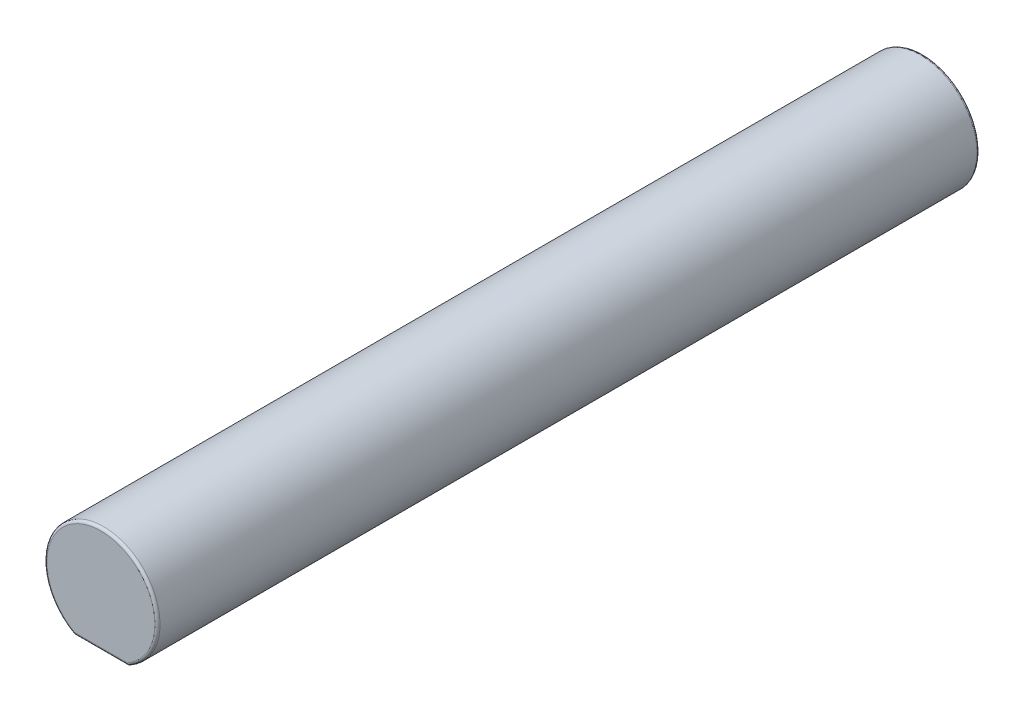
ISO-10303-21;
HEADER;
FILE_DESCRIPTION(('STEP AP214'),'2;1');
FILE_NAME('part.step','',(''),(''),'','','');
FILE_SCHEMA(('AUTOMOTIVE_DESIGN { 1 0 10303 214 1 1 1 1 }'));
ENDSEC;
DATA;
#1=APPLICATION_CONTEXT('core data for automotive mechanical design processes');
#2=APPLICATION_PROTOCOL_DEFINITION('international standard','automotive_design',2000,#1);
#3=PRODUCT_CONTEXT('',#1,'mechanical');
#4=PRODUCT('Part','Part','',(#3));
#5=PRODUCT_RELATED_PRODUCT_CATEGORY('part','',(#4));
#6=PRODUCT_DEFINITION_FORMATION('','',#4);
#7=PRODUCT_DEFINITION_CONTEXT('part definition',#1,'design');
#8=PRODUCT_DEFINITION('design','',#6,#7);
#9=PRODUCT_DEFINITION_SHAPE('','',#8);
#10=(LENGTH_UNIT() NAMED_UNIT(*) SI_UNIT(.MILLI.,.METRE.));
#11=(NAMED_UNIT(*) PLANE_ANGLE_UNIT() SI_UNIT($,.RADIAN.));
#12=(NAMED_UNIT(*) SI_UNIT($,.STERADIAN.) SOLID_ANGLE_UNIT());
#13=UNCERTAINTY_MEASURE_WITH_UNIT(LENGTH_MEASURE(1.E-05),#10,'distance_accuracy_value','');
#14=(GEOMETRIC_REPRESENTATION_CONTEXT(3) GLOBAL_UNCERTAINTY_ASSIGNED_CONTEXT((#13)) GLOBAL_UNIT_ASSIGNED_CONTEXT((#10,
#11,#12)) REPRESENTATION_CONTEXT('',''));
#15=CARTESIAN_POINT('',(0.,0.,0.));
#16=DIRECTION('',(0.,0.,1.));
#17=DIRECTION('',(1.,0.,0.));
#18=AXIS2_PLACEMENT_3D('',#15,#16,#17);
#19=CARTESIAN_POINT('',(10.5,18.,171.));
#20=DIRECTION('',(0.,0.,1.));
#21=DIRECTION('',(1.,0.,0.));
#22=AXIS2_PLACEMENT_3D('',#19,#20,#21);
#23=PLANE('',#22);
#24=DIRECTION('',(1.,0.,0.));
#25=VECTOR('',#24,1.);
#26=CARTESIAN_POINT('',(10.5,-10.1326149291812,171.));
#27=LINE('',#26,#25);
#28=CARTESIAN_POINT('',(4.90559839249728,-10.1326149291812,171.));
#29=VERTEX_POINT('',#28);
#30=CARTESIAN_POINT('',(10.5,-10.1326149291812,171.));
#31=VERTEX_POINT('',#30);
#32=EDGE_CURVE('E173',#29,#31,#27,.T.);
#33=ORIENTED_EDGE('',*,*,#32,.F.);
#34=DIRECTION('',(0.,-1.,0.));
#35=VECTOR('',#34,1.);
#36=CARTESIAN_POINT('',(4.90559839249728,129.432758120554,171.));
#37=LINE('',#36,#35);
#38=CARTESIAN_POINT('',(4.90559839249728,18.,171.));
#39=VERTEX_POINT('',#38);
#40=EDGE_CURVE('E160',#39,#29,#37,.T.);
#41=ORIENTED_EDGE('',*,*,#40,.F.);
#42=DIRECTION('',(-1.,0.,0.));
#43=VECTOR('',#42,1.);
#44=CARTESIAN_POINT('',(10.5,18.,171.));
#45=LINE('',#44,#43);
#46=CARTESIAN_POINT('',(10.5,18.,171.));
#47=VERTEX_POINT('',#46);
#48=EDGE_CURVE('E172',#47,#39,#45,.T.);
#49=ORIENTED_EDGE('',*,*,#48,.F.);
#50=DIRECTION('',(0.,-1.,0.));
#51=VECTOR('',#50,1.);
#52=CARTESIAN_POINT('',(10.5,18.,171.));
#53=LINE('',#52,#51);
#54=EDGE_CURVE('E195',#47,#31,#53,.T.);
#55=ORIENTED_EDGE('',*,*,#54,.T.);
#56=EDGE_LOOP('',(#33,#41,#49,#55));
#57=FACE_BOUND('',#56,.T.);
#58=ADVANCED_FACE('F32',(#57),#23,.F.);
#59=CARTESIAN_POINT('',(10.5,-10.1326149291812,179.));
#60=DIRECTION('',(0.,0.,1.));
#61=DIRECTION('',(1.,0.,0.));
#62=AXIS2_PLACEMENT_3D('',#59,#60,#61);
#63=PLANE('',#62);
#64=DIRECTION('',(-1.,0.,0.));
#65=VECTOR('',#64,1.);
#66=CARTESIAN_POINT('',(10.5,-19.3326149291812,179.));
#67=LINE('',#66,#65);
#68=CARTESIAN_POINT('',(10.5,-19.3326149291812,179.));
#69=VERTEX_POINT('',#68);
#70=CARTESIAN_POINT('',(4.90559839249728,-19.3326149291812,179.));
#71=VERTEX_POINT('',#70);
#72=EDGE_CURVE('E313',#69,#71,#67,.T.);
#73=ORIENTED_EDGE('',*,*,#72,.T.);
#74=DIRECTION('',(0.,1.,0.));
#75=VECTOR('',#74,1.);
#76=CARTESIAN_POINT('',(4.90559839249728,-10.1326149291812,179.));
#77=LINE('',#76,#75);
#78=CARTESIAN_POINT('',(4.90559839249728,-10.1326149291812,179.));
#79=VERTEX_POINT('',#78);
#80=EDGE_CURVE('E315',#71,#79,#77,.T.);
#81=ORIENTED_EDGE('',*,*,#80,.T.);
#82=DIRECTION('',(-1.,0.,0.));
#83=VECTOR('',#82,1.);
#84=CARTESIAN_POINT('',(10.5,-10.1326149291812,179.));
#85=LINE('',#84,#83);
#86=CARTESIAN_POINT('',(10.5,-10.1326149291812,179.));
#87=VERTEX_POINT('',#86);
#88=EDGE_CURVE('E373',#87,#79,#85,.T.);
#89=ORIENTED_EDGE('',*,*,#88,.F.);
#90=DIRECTION('',(0.,-1.,0.));
#91=VECTOR('',#90,1.);
#92=CARTESIAN_POINT('',(10.5,-10.1326149291812,179.));
#93=LINE('',#92,#91);
#94=EDGE_CURVE('E317',#87,#69,#93,.T.);
#95=ORIENTED_EDGE('',*,*,#94,.T.);
#96=EDGE_LOOP('',(#73,#81,#89,#95));
#97=FACE_BOUND('',#96,.T.);
#98=ADVANCED_FACE('F286',(#97),#63,.F.);
#99=CARTESIAN_POINT('',(0.,-10.1326149291812,0.));
#100=DIRECTION('',(0.,-1.,0.));
#101=DIRECTION('',(1.,0.,0.));
#102=AXIS2_PLACEMENT_3D('',#99,#100,#101);
#103=PLANE('',#102);
#104=DIRECTION('',(0.,0.,1.));
#105=VECTOR('',#104,1.);
#106=CARTESIAN_POINT('',(4.90559839249728,-10.1326149291812,0.));
#107=LINE('',#106,#105);
#108=EDGE_CURVE('E205',#29,#79,#107,.T.);
#109=ORIENTED_EDGE('',*,*,#108,.F.);
#110=ORIENTED_EDGE('',*,*,#32,.T.);
#111=DIRECTION('',(0.,0.,1.));
#112=VECTOR('',#111,1.);
#113=CARTESIAN_POINT('',(10.5,-10.1326149291812,171.));
#114=LINE('',#113,#112);
#115=EDGE_CURVE('E319',#31,#87,#114,.T.);
#116=ORIENTED_EDGE('',*,*,#115,.T.);
#117=ORIENTED_EDGE('',*,*,#88,.T.);
#118=EDGE_LOOP('',(#109,#110,#116,#117));
#119=FACE_BOUND('',#118,.T.);
#120=ADVANCED_FACE('F260',(#119),#103,.T.);
#121=CARTESIAN_POINT('',(-4.90559839249727,18.,171.));
#122=VERTEX_POINT('',#121);
#123=CARTESIAN_POINT('',(-10.5,18.,171.));
#124=VERTEX_POINT('',#123);
#125=EDGE_CURVE('E183',#122,#124,#45,.T.);
#126=ORIENTED_EDGE('',*,*,#125,.F.);
#127=DIRECTION('',(0.,-1.,0.));
#128=VECTOR('',#127,1.);
#129=CARTESIAN_POINT('',(-4.90559839249727,129.432758120554,171.));
#130=LINE('',#129,#128);
#131=CARTESIAN_POINT('',(-4.90559839249727,-10.1326149291812,171.));
#132=VERTEX_POINT('',#131);
#133=EDGE_CURVE('E384',#122,#132,#130,.T.);
#134=ORIENTED_EDGE('',*,*,#133,.T.);
#135=CARTESIAN_POINT('',(-10.5,-10.1326149291812,171.));
#136=VERTEX_POINT('',#135);
#137=EDGE_CURVE('E328',#136,#132,#27,.T.);
#138=ORIENTED_EDGE('',*,*,#137,.F.);
#139=DIRECTION('',(0.,-1.,0.));
#140=VECTOR('',#139,1.);
#141=CARTESIAN_POINT('',(-10.5,18.,171.));
#142=LINE('',#141,#140);
#143=EDGE_CURVE('E191',#124,#136,#142,.T.);
#144=ORIENTED_EDGE('',*,*,#143,.F.);
#145=EDGE_LOOP('',(#126,#134,#138,#144));
#146=FACE_BOUND('',#145,.T.);
#147=ADVANCED_FACE('F237',(#146),#23,.F.);
#148=CARTESIAN_POINT('',(0.,0.,320.));
#149=DIRECTION('',(0.,0.,-1.));
#150=DIRECTION('',(-1.,0.,0.));
#151=AXIS2_PLACEMENT_3D('',#148,#149,#150);
#152=CYLINDRICAL_SURFACE('',#151,22.);
#153=CARTESIAN_POINT('',(0.,0.,1.));
#154=DIRECTION('',(0.,0.,1.));
#155=DIRECTION('',(1.,0.,0.));
#156=AXIS2_PLACEMENT_3D('',#153,#154,#155);
#157=CIRCLE('',#156,22.);
#158=CARTESIAN_POINT('',(22.,0.,1.));
#159=VERTEX_POINT('',#158);
#160=EDGE_CURVE('E207',#159,#159,#157,.T.);
#161=ORIENTED_EDGE('',*,*,#160,.T.);
#162=EDGE_LOOP('',(#161));
#163=FACE_BOUND('',#162,.T.);
#164=DIRECTION('',(0.,0.,1.));
#165=VECTOR('',#164,1.);
#166=CARTESIAN_POINT('',(-10.5,-19.3326149291812,41.));
#167=LINE('',#166,#165);
#168=CARTESIAN_POINT('',(-10.5,-19.3326149291812,179.));
#169=VERTEX_POINT('',#168);
#170=CARTESIAN_POINT('',(-10.5,-19.3326149291812,319.));
#171=VERTEX_POINT('',#170);
#172=EDGE_CURVE('E362',#169,#171,#167,.T.);
#173=ORIENTED_EDGE('',*,*,#172,.T.);
#174=CARTESIAN_POINT('',(0.,0.,319.));
#175=DIRECTION('',(0.,0.,1.));
#176=DIRECTION('',(1.,0.,0.));
#177=AXIS2_PLACEMENT_3D('',#174,#175,#176);
#178=CIRCLE('',#177,22.);
#179=CARTESIAN_POINT('',(10.5,-19.3326149291812,319.));
#180=VERTEX_POINT('',#179);
#181=EDGE_CURVE('E11',#171,#180,#178,.F.);
#182=ORIENTED_EDGE('',*,*,#181,.T.);
#183=DIRECTION('',(0.,0.,1.));
#184=VECTOR('',#183,1.);
#185=CARTESIAN_POINT('',(10.5,-19.3326149291812,41.));
#186=LINE('',#185,#184);
#187=EDGE_CURVE('E358',#69,#180,#186,.T.);
#188=ORIENTED_EDGE('',*,*,#187,.F.);
#189=DIRECTION('',(0.,0.,-1.));
#190=VECTOR('',#189,1.);
#191=CARTESIAN_POINT('',(10.5,-19.3326149291812,320.));
#192=LINE('',#191,#190);
#193=CARTESIAN_POINT('',(10.5,-19.3326149291812,121.));
#194=VERTEX_POINT('',#193);
#195=EDGE_CURVE('E201',#69,#194,#192,.T.);
#196=ORIENTED_EDGE('',*,*,#195,.T.);
#197=CARTESIAN_POINT('',(10.5,-19.3326149291812,41.));
#198=VERTEX_POINT('',#197);
#199=EDGE_CURVE('E359',#198,#194,#186,.T.);
#200=ORIENTED_EDGE('',*,*,#199,.F.);
#201=CARTESIAN_POINT('',(0.,0.,41.));
#202=DIRECTION('',(0.,0.,-1.));
#203=DIRECTION('',(1.,0.,0.));
#204=AXIS2_PLACEMENT_3D('',#201,#202,#203);
#205=CIRCLE('',#204,22.);
#206=CARTESIAN_POINT('',(-10.5,-19.3326149291812,41.));
#207=VERTEX_POINT('',#206);
#208=EDGE_CURVE('E333',#198,#207,#205,.T.);
#209=ORIENTED_EDGE('',*,*,#208,.T.);
#210=CARTESIAN_POINT('',(-10.5,-19.3326149291812,121.));
#211=VERTEX_POINT('',#210);
#212=EDGE_CURVE('E363',#207,#211,#167,.T.);
#213=ORIENTED_EDGE('',*,*,#212,.T.);
#214=DIRECTION('',(0.,0.,-1.));
#215=VECTOR('',#214,1.);
#216=CARTESIAN_POINT('',(-10.5,-19.3326149291812,320.));
#217=LINE('',#216,#215);
#218=EDGE_CURVE('E194',#211,#169,#217,.F.);
#219=ORIENTED_EDGE('',*,*,#218,.T.);
#220=EDGE_LOOP('',(#173,#182,#188,#196,#200,#209,#213,#219));
#221=FACE_BOUND('',#220,.T.);
#222=ADVANCED_FACE('F233',(#163,#221),#152,.T.);
#223=CARTESIAN_POINT('',(0.,0.,320.));
#224=DIRECTION('',(0.,0.,1.));
#225=DIRECTION('',(1.,0.,0.));
#226=AXIS2_PLACEMENT_3D('',#223,#224,#225);
#227=PLANE('',#226);
#228=CARTESIAN_POINT('',(0.,0.,320.));
#229=DIRECTION('',(0.,0.,1.));
#230=DIRECTION('',(1.,0.,0.));
#231=AXIS2_PLACEMENT_3D('',#228,#229,#230);
#232=CIRCLE('',#231,21.);
#233=CARTESIAN_POINT('',(10.2428135713955,-18.3326149291812,320.));
#234=VERTEX_POINT('',#233);
#235=CARTESIAN_POINT('',(-10.2428135713955,-18.3326149291812,320.));
#236=VERTEX_POINT('',#235);
#237=EDGE_CURVE('E213',#234,#236,#232,.T.);
#238=ORIENTED_EDGE('',*,*,#237,.T.);
#239=DIRECTION('',(1.,0.,0.));
#240=VECTOR('',#239,1.);
#241=CARTESIAN_POINT('',(0.,-18.3326149291812,320.));
#242=LINE('',#241,#240);
#243=EDGE_CURVE('E215',#236,#234,#242,.T.);
#244=ORIENTED_EDGE('',*,*,#243,.T.);
#245=EDGE_LOOP('',(#238,#244));
#246=FACE_BOUND('',#245,.T.);
#247=ADVANCED_FACE('F236',(#246),#227,.T.);
#248=CARTESIAN_POINT('',(10.5,18.,129.));
#249=DIRECTION('',(0.,0.,-1.));
#250=DIRECTION('',(-1.,0.,0.));
#251=AXIS2_PLACEMENT_3D('',#248,#249,#250);
#252=PLANE('',#251);
#253=DIRECTION('',(0.,-1.,0.));
#254=VECTOR('',#253,1.);
#255=CARTESIAN_POINT('',(-10.5,18.,129.));
#256=LINE('',#255,#254);
#257=CARTESIAN_POINT('',(-10.5,18.,129.));
#258=VERTEX_POINT('',#257);
#259=CARTESIAN_POINT('',(-10.5,-10.1326149291812,129.));
#260=VERTEX_POINT('',#259);
#261=EDGE_CURVE('E182',#258,#260,#256,.T.);
#262=ORIENTED_EDGE('',*,*,#261,.T.);
#263=DIRECTION('',(-1.,0.,0.));
#264=VECTOR('',#263,1.);
#265=CARTESIAN_POINT('',(10.5,-10.1326149291812,129.));
#266=LINE('',#265,#264);
#267=CARTESIAN_POINT('',(10.5,-10.1326149291812,129.));
#268=VERTEX_POINT('',#267);
#269=EDGE_CURVE('E337',#268,#260,#266,.T.);
#270=ORIENTED_EDGE('',*,*,#269,.F.);
#271=DIRECTION('',(0.,-1.,0.));
#272=VECTOR('',#271,1.);
#273=CARTESIAN_POINT('',(10.5,18.,129.));
#274=LINE('',#273,#272);
#275=CARTESIAN_POINT('',(10.5,18.,129.));
#276=VERTEX_POINT('',#275);
#277=EDGE_CURVE('E186',#276,#268,#274,.T.);
#278=ORIENTED_EDGE('',*,*,#277,.F.);
#279=DIRECTION('',(1.,0.,0.));
#280=VECTOR('',#279,1.);
#281=CARTESIAN_POINT('',(10.5,18.,129.));
#282=LINE('',#281,#280);
#283=EDGE_CURVE('E367',#258,#276,#282,.T.);
#284=ORIENTED_EDGE('',*,*,#283,.F.);
#285=EDGE_LOOP('',(#262,#270,#278,#284));
#286=FACE_BOUND('',#285,.T.);
#287=ADVANCED_FACE('F243',(#286),#252,.F.);
#288=CARTESIAN_POINT('',(0.,0.,0.));
#289=DIRECTION('',(0.,0.,1.));
#290=DIRECTION('',(1.,0.,0.));
#291=AXIS2_PLACEMENT_3D('',#288,#289,#290);
#292=PLANE('',#291);
#293=CARTESIAN_POINT('',(0.,0.,0.));
#294=DIRECTION('',(0.,0.,1.));
#295=DIRECTION('',(1.,0.,0.));
#296=AXIS2_PLACEMENT_3D('',#293,#294,#295);
#297=CIRCLE('',#296,21.);
#298=CARTESIAN_POINT('',(21.,0.,0.));
#299=VERTEX_POINT('',#298);
#300=EDGE_CURVE('E210',#299,#299,#297,.F.);
#301=ORIENTED_EDGE('',*,*,#300,.T.);
#302=EDGE_LOOP('',(#301));
#303=FACE_BOUND('',#302,.T.);
#304=ADVANCED_FACE('F239',(#303),#292,.F.);
#305=CARTESIAN_POINT('',(-10.5,18.,171.));
#306=DIRECTION('',(-1.,0.,0.));
#307=DIRECTION('',(0.,0.,1.));
#308=AXIS2_PLACEMENT_3D('',#305,#306,#307);
#309=PLANE('',#308);
#310=ORIENTED_EDGE('',*,*,#261,.F.);
#311=DIRECTION('',(0.,0.,-1.));
#312=VECTOR('',#311,1.);
#313=CARTESIAN_POINT('',(-10.5,18.,171.));
#314=LINE('',#313,#312);
#315=EDGE_CURVE('E366',#124,#258,#314,.T.);
#316=ORIENTED_EDGE('',*,*,#315,.F.);
#317=ORIENTED_EDGE('',*,*,#143,.T.);
#318=DIRECTION('',(0.,0.,-1.));
#319=VECTOR('',#318,1.);
#320=CARTESIAN_POINT('',(-10.5,-10.1326149291812,171.));
#321=LINE('',#320,#319);
#322=CARTESIAN_POINT('',(-10.5,-10.1326149291812,179.));
#323=VERTEX_POINT('',#322);
#324=EDGE_CURVE('E374',#323,#136,#321,.T.);
#325=ORIENTED_EDGE('',*,*,#324,.F.);
#326=DIRECTION('',(0.,-1.,0.));
#327=VECTOR('',#326,1.);
#328=CARTESIAN_POINT('',(-10.5,-10.1326149291812,179.));
#329=LINE('',#328,#327);
#330=EDGE_CURVE('E330',#323,#169,#329,.T.);
#331=ORIENTED_EDGE('',*,*,#330,.T.);
#332=ORIENTED_EDGE('',*,*,#218,.F.);
#333=DIRECTION('',(0.,-1.,0.));
#334=VECTOR('',#333,1.);
#335=CARTESIAN_POINT('',(-10.5,-10.1326149291812,121.));
#336=LINE('',#335,#334);
#337=CARTESIAN_POINT('',(-10.5,-10.1326149291812,121.));
#338=VERTEX_POINT('',#337);
#339=EDGE_CURVE('E347',#338,#211,#336,.T.);
#340=ORIENTED_EDGE('',*,*,#339,.F.);
#341=DIRECTION('',(0.,0.,-1.));
#342=VECTOR('',#341,1.);
#343=CARTESIAN_POINT('',(-10.5,-10.1326149291812,129.));
#344=LINE('',#343,#342);
#345=EDGE_CURVE('E341',#260,#338,#344,.T.);
#346=ORIENTED_EDGE('',*,*,#345,.F.);
#347=EDGE_LOOP('',(#310,#316,#317,#325,#331,#332,#340,#346));
#348=FACE_BOUND('',#347,.T.);
#349=ADVANCED_FACE('F242',(#348),#309,.F.);
#350=CARTESIAN_POINT('',(10.5,18.,171.));
#351=DIRECTION('',(1.,0.,0.));
#352=DIRECTION('',(0.,0.,-1.));
#353=AXIS2_PLACEMENT_3D('',#350,#351,#352);
#354=PLANE('',#353);
#355=ORIENTED_EDGE('',*,*,#54,.F.);
#356=DIRECTION('',(0.,0.,1.));
#357=VECTOR('',#356,1.);
#358=CARTESIAN_POINT('',(10.5,18.,171.));
#359=LINE('',#358,#357);
#360=EDGE_CURVE('E181',#276,#47,#359,.T.);
#361=ORIENTED_EDGE('',*,*,#360,.F.);
#362=ORIENTED_EDGE('',*,*,#277,.T.);
#363=DIRECTION('',(0.,0.,1.));
#364=VECTOR('',#363,1.);
#365=CARTESIAN_POINT('',(10.5,-10.1326149291812,129.));
#366=LINE('',#365,#364);
#367=CARTESIAN_POINT('',(10.5,-10.1326149291812,121.));
#368=VERTEX_POINT('',#367);
#369=EDGE_CURVE('E335',#368,#268,#366,.T.);
#370=ORIENTED_EDGE('',*,*,#369,.F.);
#371=DIRECTION('',(0.,-1.,0.));
#372=VECTOR('',#371,1.);
#373=CARTESIAN_POINT('',(10.5,-10.1326149291812,121.));
#374=LINE('',#373,#372);
#375=EDGE_CURVE('E325',#368,#194,#374,.T.);
#376=ORIENTED_EDGE('',*,*,#375,.T.);
#377=ORIENTED_EDGE('',*,*,#195,.F.);
#378=ORIENTED_EDGE('',*,*,#94,.F.);
#379=ORIENTED_EDGE('',*,*,#115,.F.);
#380=EDGE_LOOP('',(#355,#361,#362,#370,#376,#377,#378,#379));
#381=FACE_BOUND('',#380,.T.);
#382=ADVANCED_FACE('F250',(#381),#354,.F.);
#383=CARTESIAN_POINT('',(0.,18.,0.));
#384=DIRECTION('',(0.,1.,0.));
#385=DIRECTION('',(0.,0.,1.));
#386=AXIS2_PLACEMENT_3D('',#383,#384,#385);
#387=PLANE('',#386);
#388=ORIENTED_EDGE('',*,*,#315,.T.);
#389=ORIENTED_EDGE('',*,*,#283,.T.);
#390=ORIENTED_EDGE('',*,*,#360,.T.);
#391=ORIENTED_EDGE('',*,*,#48,.T.);
#392=DIRECTION('',(0.,0.,1.));
#393=VECTOR('',#392,1.);
#394=CARTESIAN_POINT('',(4.90559839249728,18.,282.));
#395=LINE('',#394,#393);
#396=CARTESIAN_POINT('',(4.90559839249728,18.,282.));
#397=VERTEX_POINT('',#396);
#398=EDGE_CURVE('E157',#39,#397,#395,.T.);
#399=ORIENTED_EDGE('',*,*,#398,.T.);
#400=DIRECTION('',(-1.,0.,0.));
#401=VECTOR('',#400,1.);
#402=CARTESIAN_POINT('',(4.90559839249728,18.,282.));
#403=LINE('',#402,#401);
#404=CARTESIAN_POINT('',(-4.90559839249727,18.,282.));
#405=VERTEX_POINT('',#404);
#406=EDGE_CURVE('E389',#397,#405,#403,.T.);
#407=ORIENTED_EDGE('',*,*,#406,.T.);
#408=DIRECTION('',(0.,0.,-1.));
#409=VECTOR('',#408,1.);
#410=CARTESIAN_POINT('',(-4.90559839249727,18.,282.));
#411=LINE('',#410,#409);
#412=EDGE_CURVE('E386',#405,#122,#411,.T.);
#413=ORIENTED_EDGE('',*,*,#412,.T.);
#414=ORIENTED_EDGE('',*,*,#125,.T.);
#415=EDGE_LOOP('',(#388,#389,#390,#391,#399,#407,#413,#414));
#416=FACE_BOUND('',#415,.T.);
#417=ADVANCED_FACE('F178',(#416),#387,.F.);
#418=CARTESIAN_POINT('',(-10.5,-19.3326149291812,41.));
#419=DIRECTION('',(0.,-1.,0.));
#420=DIRECTION('',(0.,0.,-1.));
#421=AXIS2_PLACEMENT_3D('',#418,#419,#420);
#422=PLANE('',#421);
#423=DIRECTION('',(1.,0.,0.));
#424=VECTOR('',#423,1.);
#425=CARTESIAN_POINT('',(10.5,-19.3326149291812,121.));
#426=LINE('',#425,#424);
#427=EDGE_CURVE('E338',#211,#194,#426,.T.);
#428=ORIENTED_EDGE('',*,*,#427,.F.);
#429=ORIENTED_EDGE('',*,*,#212,.F.);
#430=DIRECTION('',(1.,0.,0.));
#431=VECTOR('',#430,1.);
#432=CARTESIAN_POINT('',(-10.5,-19.3326149291812,41.));
#433=LINE('',#432,#431);
#434=EDGE_CURVE('E356',#207,#198,#433,.T.);
#435=ORIENTED_EDGE('',*,*,#434,.T.);
#436=ORIENTED_EDGE('',*,*,#199,.T.);
#437=EDGE_LOOP('',(#428,#429,#435,#436));
#438=FACE_BOUND('',#437,.T.);
#439=ADVANCED_FACE('F264',(#438),#422,.T.);
#440=CARTESIAN_POINT('',(0.,0.,41.));
#441=DIRECTION('',(0.,0.,1.));
#442=DIRECTION('',(1.,0.,0.));
#443=AXIS2_PLACEMENT_3D('',#440,#441,#442);
#444=PLANE('',#443);
#445=ORIENTED_EDGE('',*,*,#208,.F.);
#446=ORIENTED_EDGE('',*,*,#434,.F.);
#447=EDGE_LOOP('',(#445,#446));
#448=FACE_BOUND('',#447,.T.);
#449=ADVANCED_FACE('F269',(#448),#444,.T.);
#450=ORIENTED_EDGE('',*,*,#187,.T.);
#451=DIRECTION('',(1.,0.,0.));
#452=VECTOR('',#451,1.);
#453=CARTESIAN_POINT('',(-10.5,-19.3326149291812,319.));
#454=LINE('',#453,#452);
#455=EDGE_CURVE('E45',#180,#171,#454,.F.);
#456=ORIENTED_EDGE('',*,*,#455,.T.);
#457=ORIENTED_EDGE('',*,*,#172,.F.);
#458=CARTESIAN_POINT('',(-4.90559839249727,-19.3326149291812,179.));
#459=VERTEX_POINT('',#458);
#460=EDGE_CURVE('E320',#459,#169,#67,.T.);
#461=ORIENTED_EDGE('',*,*,#460,.F.);
#462=DIRECTION('',(0.,0.,-1.));
#463=VECTOR('',#462,1.);
#464=CARTESIAN_POINT('',(-4.90559839249727,-19.3326149291812,282.));
#465=LINE('',#464,#463);
#466=CARTESIAN_POINT('',(-4.90559839249727,-19.3326149291812,282.));
#467=VERTEX_POINT('',#466);
#468=EDGE_CURVE('E394',#467,#459,#465,.T.);
#469=ORIENTED_EDGE('',*,*,#468,.F.);
#470=DIRECTION('',(-1.,0.,0.));
#471=VECTOR('',#470,1.);
#472=CARTESIAN_POINT('',(4.90559839249728,-19.3326149291812,282.));
#473=LINE('',#472,#471);
#474=CARTESIAN_POINT('',(4.90559839249728,-19.3326149291812,282.));
#475=VERTEX_POINT('',#474);
#476=EDGE_CURVE('E174',#475,#467,#473,.T.);
#477=ORIENTED_EDGE('',*,*,#476,.F.);
#478=DIRECTION('',(0.,0.,1.));
#479=VECTOR('',#478,1.);
#480=CARTESIAN_POINT('',(4.90559839249728,-19.3326149291812,282.));
#481=LINE('',#480,#479);
#482=EDGE_CURVE('E396',#71,#475,#481,.T.);
#483=ORIENTED_EDGE('',*,*,#482,.F.);
#484=ORIENTED_EDGE('',*,*,#72,.F.);
#485=EDGE_LOOP('',(#450,#456,#457,#461,#469,#477,#483,#484));
#486=FACE_BOUND('',#485,.T.);
#487=ADVANCED_FACE('F265',(#486),#422,.T.);
#488=CARTESIAN_POINT('',(-4.90559839249726,-10.1326149291812,179.));
#489=VERTEX_POINT('',#488);
#490=EDGE_CURVE('E323',#489,#323,#85,.T.);
#491=ORIENTED_EDGE('',*,*,#490,.F.);
#492=DIRECTION('',(0.,-1.,0.));
#493=VECTOR('',#492,1.);
#494=CARTESIAN_POINT('',(-4.90559839249727,-10.1326149291812,179.));
#495=LINE('',#494,#493);
#496=EDGE_CURVE('E381',#489,#459,#495,.T.);
#497=ORIENTED_EDGE('',*,*,#496,.T.);
#498=ORIENTED_EDGE('',*,*,#460,.T.);
#499=ORIENTED_EDGE('',*,*,#330,.F.);
#500=EDGE_LOOP('',(#491,#497,#498,#499));
#501=FACE_BOUND('',#500,.T.);
#502=ADVANCED_FACE('F268',(#501),#63,.F.);
#503=DIRECTION('',(0.,0.,-1.));
#504=VECTOR('',#503,1.);
#505=CARTESIAN_POINT('',(-4.90559839249727,-10.1326149291812,0.));
#506=LINE('',#505,#504);
#507=EDGE_CURVE('E203',#489,#132,#506,.T.);
#508=ORIENTED_EDGE('',*,*,#507,.F.);
#509=ORIENTED_EDGE('',*,*,#490,.T.);
#510=ORIENTED_EDGE('',*,*,#324,.T.);
#511=ORIENTED_EDGE('',*,*,#137,.T.);
#512=EDGE_LOOP('',(#508,#509,#510,#511));
#513=FACE_BOUND('',#512,.T.);
#514=ADVANCED_FACE('F278',(#513),#103,.T.);
#515=CARTESIAN_POINT('',(10.5,-10.1326149291812,121.));
#516=DIRECTION('',(0.,0.,-1.));
#517=DIRECTION('',(-1.,0.,0.));
#518=AXIS2_PLACEMENT_3D('',#515,#516,#517);
#519=PLANE('',#518);
#520=ORIENTED_EDGE('',*,*,#427,.T.);
#521=ORIENTED_EDGE('',*,*,#375,.F.);
#522=DIRECTION('',(1.,0.,0.));
#523=VECTOR('',#522,1.);
#524=CARTESIAN_POINT('',(10.5,-10.1326149291812,121.));
#525=LINE('',#524,#523);
#526=EDGE_CURVE('E344',#338,#368,#525,.T.);
#527=ORIENTED_EDGE('',*,*,#526,.F.);
#528=ORIENTED_EDGE('',*,*,#339,.T.);
#529=EDGE_LOOP('',(#520,#521,#527,#528));
#530=FACE_BOUND('',#529,.T.);
#531=ADVANCED_FACE('F274',(#530),#519,.F.);
#532=CARTESIAN_POINT('',(0.,-10.1326149291812,0.));
#533=DIRECTION('',(0.,1.,0.));
#534=DIRECTION('',(-1.,0.,0.));
#535=AXIS2_PLACEMENT_3D('',#532,#533,#534);
#536=PLANE('',#535);
#537=ORIENTED_EDGE('',*,*,#369,.T.);
#538=ORIENTED_EDGE('',*,*,#269,.T.);
#539=ORIENTED_EDGE('',*,*,#345,.T.);
#540=ORIENTED_EDGE('',*,*,#526,.T.);
#541=EDGE_LOOP('',(#537,#538,#539,#540));
#542=FACE_BOUND('',#541,.T.);
#543=ADVANCED_FACE('F277',(#542),#536,.F.);
#544=CARTESIAN_POINT('',(4.90559839249728,129.432758120554,282.));
#545=DIRECTION('',(1.,0.,0.));
#546=DIRECTION('',(0.,0.,-1.));
#547=AXIS2_PLACEMENT_3D('',#544,#545,#546);
#548=PLANE('',#547);
#549=ORIENTED_EDGE('',*,*,#482,.T.);
#550=DIRECTION('',(0.,-1.,0.));
#551=VECTOR('',#550,1.);
#552=CARTESIAN_POINT('',(4.90559839249728,129.432758120554,282.));
#553=LINE('',#552,#551);
#554=EDGE_CURVE('E163',#397,#475,#553,.T.);
#555=ORIENTED_EDGE('',*,*,#554,.F.);
#556=ORIENTED_EDGE('',*,*,#398,.F.);
#557=ORIENTED_EDGE('',*,*,#40,.T.);
#558=ORIENTED_EDGE('',*,*,#108,.T.);
#559=ORIENTED_EDGE('',*,*,#80,.F.);
#560=EDGE_LOOP('',(#549,#555,#556,#557,#558,#559));
#561=FACE_BOUND('',#560,.T.);
#562=ADVANCED_FACE('F159',(#561),#548,.F.);
#563=CARTESIAN_POINT('',(-4.90559839249727,129.432758120554,282.));
#564=DIRECTION('',(-1.,0.,0.));
#565=DIRECTION('',(0.,0.,1.));
#566=AXIS2_PLACEMENT_3D('',#563,#564,#565);
#567=PLANE('',#566);
#568=ORIENTED_EDGE('',*,*,#507,.T.);
#569=ORIENTED_EDGE('',*,*,#133,.F.);
#570=ORIENTED_EDGE('',*,*,#412,.F.);
#571=DIRECTION('',(0.,-1.,0.));
#572=VECTOR('',#571,1.);
#573=CARTESIAN_POINT('',(-4.90559839249727,129.432758120554,282.));
#574=LINE('',#573,#572);
#575=EDGE_CURVE('E390',#405,#467,#574,.T.);
#576=ORIENTED_EDGE('',*,*,#575,.T.);
#577=ORIENTED_EDGE('',*,*,#468,.T.);
#578=ORIENTED_EDGE('',*,*,#496,.F.);
#579=EDGE_LOOP('',(#568,#569,#570,#576,#577,#578));
#580=FACE_BOUND('',#579,.T.);
#581=ADVANCED_FACE('F292',(#580),#567,.F.);
#582=CARTESIAN_POINT('',(4.90559839249728,129.432758120554,282.));
#583=DIRECTION('',(0.,0.,1.));
#584=DIRECTION('',(1.,0.,0.));
#585=AXIS2_PLACEMENT_3D('',#582,#583,#584);
#586=PLANE('',#585);
#587=ORIENTED_EDGE('',*,*,#554,.T.);
#588=ORIENTED_EDGE('',*,*,#476,.T.);
#589=ORIENTED_EDGE('',*,*,#575,.F.);
#590=ORIENTED_EDGE('',*,*,#406,.F.);
#591=EDGE_LOOP('',(#587,#588,#589,#590));
#592=FACE_BOUND('',#591,.T.);
#593=ADVANCED_FACE('F231',(#592),#586,.F.);
#594=CARTESIAN_POINT('',(0.,0.,1.));
#595=DIRECTION('',(0.,0.,1.));
#596=DIRECTION('',(1.,0.,0.));
#597=AXIS2_PLACEMENT_3D('',#594,#595,#596);
#598=TOROIDAL_SURFACE('',#597,21.,1.);
#599=ORIENTED_EDGE('',*,*,#300,.F.);
#600=EDGE_LOOP('',(#599));
#601=FACE_BOUND('',#600,.T.);
#602=ORIENTED_EDGE('',*,*,#160,.F.);
#603=EDGE_LOOP('',(#602));
#604=FACE_BOUND('',#603,.T.);
#605=ADVANCED_FACE('F227',(#601,#604),#598,.T.);
#606=CARTESIAN_POINT('',(0.,0.,319.));
#607=DIRECTION('',(0.,0.,1.));
#608=DIRECTION('',(1.,0.,0.));
#609=AXIS2_PLACEMENT_3D('',#606,#607,#608);
#610=TOROIDAL_SURFACE('',#609,21.,1.);
#611=CARTESIAN_POINT('',(10.5,-19.3326149291812,319.));
#612=CARTESIAN_POINT('',(10.500000027476,-19.3326151895903,319.027502184909));
#613=CARTESIAN_POINT('',(10.4997115950967,-19.3314796245348,319.054990971869));
#614=CARTESIAN_POINT('',(10.4985614294151,-19.3269523787884,319.1097670604));
#615=CARTESIAN_POINT('',(10.4976997583212,-19.3235609429074,319.137054383509));
#616=CARTESIAN_POINT('',(10.4942657807785,-19.3100476393717,319.218229692742));
#617=CARTESIAN_POINT('',(10.4908444687063,-19.2965866012539,319.27156606694));
#618=CARTESIAN_POINT('',(10.4818436787391,-19.2612017142233,319.375135168685));
#619=CARTESIAN_POINT('',(10.4762638126828,-19.2392763432161,319.425367336134));
#620=CARTESIAN_POINT('',(10.463116030531,-19.1876703540276,319.521392284689));
#621=CARTESIAN_POINT('',(10.4555480867724,-19.1579896279345,319.56718500401));
#622=CARTESIAN_POINT('',(10.4385350973294,-19.0913565292885,319.653706503022));
#623=CARTESIAN_POINT('',(10.4290668862838,-19.0543144788362,319.694361556079));
#624=CARTESIAN_POINT('',(10.4085843489488,-18.9743096009864,319.768907454526));
#625=CARTESIAN_POINT('',(10.397569504323,-18.9313447887325,319.802796022946));
#626=CARTESIAN_POINT('',(10.3739524731595,-18.8393877815615,319.863897218052));
#627=CARTESIAN_POINT('',(10.3613131763433,-18.7902556557077,319.890884619246));
#628=CARTESIAN_POINT('',(10.3350604773812,-18.6884078418285,319.936223947966));
#629=CARTESIAN_POINT('',(10.3214473739984,-18.6356932531457,319.954578511062));
#630=CARTESIAN_POINT('',(10.2973507733248,-18.542576899696,319.978555759875));
#631=CARTESIAN_POINT('',(10.2870062044799,-18.5026611468494,319.986272231787));
#632=CARTESIAN_POINT('',(10.2661429724918,-18.422282024592,319.99679332699));
#633=CARTESIAN_POINT('',(10.2556246562288,-18.3818197701986,319.99960676647));
#634=CARTESIAN_POINT('',(10.2443349059983,-18.3384572087579,319.999987230658));
#635=CARTESIAN_POINT('',(10.243574250898,-18.3355359518333,320.000000033194));
#636=CARTESIAN_POINT('',(10.2428135713954,-18.3326149291812,320.));
#637=B_SPLINE_CURVE_WITH_KNOTS('',3,(#611,#612,#613,#614,#615,#616,#617,#618,#619,#620,#621,
#622,#623,#624,#625,#626,#627,#628,#629,#630,#631,#632,#633,#634,#635,#636),.UNSPECIFIED.,.F.,
.F.,(4,2,2,2,2,2,2,2,2,2,2,2,4),(0.,0.0824551170551569,0.164901287438427,0.329393716025607,
0.493915738169576,0.658440049673763,0.825107291806015,0.991830524446998,1.16344889688983,
1.33501484091969,1.46060459778402,1.58596829663452,1.5950242445025),.UNSPECIFIED.);
#638=EDGE_CURVE('E219',#180,#234,#637,.T.);
#639=ORIENTED_EDGE('',*,*,#638,.F.);
#640=ORIENTED_EDGE('',*,*,#181,.F.);
#641=CARTESIAN_POINT('',(-10.5,-19.3326149291812,319.));
#642=CARTESIAN_POINT('',(-10.500000027476,-19.3326151895903,319.027502184909));
#643=CARTESIAN_POINT('',(-10.4997115950967,-19.3314796245348,319.054990971869));
#644=CARTESIAN_POINT('',(-10.4985614294151,-19.3269523787884,319.1097670604));
#645=CARTESIAN_POINT('',(-10.4976997583212,-19.3235609429074,319.137054383509));
#646=CARTESIAN_POINT('',(-10.4942657807785,-19.3100476393717,319.218229692742));
#647=CARTESIAN_POINT('',(-10.4908444687063,-19.2965866012539,319.27156606694));
#648=CARTESIAN_POINT('',(-10.4818436787391,-19.2612017142233,319.375135168685));
#649=CARTESIAN_POINT('',(-10.4762638126828,-19.2392763432161,319.425367336134));
#650=CARTESIAN_POINT('',(-10.463116030531,-19.1876703540276,319.521392284689));
#651=CARTESIAN_POINT('',(-10.4555480867724,-19.1579896279345,319.56718500401));
#652=CARTESIAN_POINT('',(-10.4385350973294,-19.0913565292885,319.653706503022));
#653=CARTESIAN_POINT('',(-10.4290668862838,-19.0543144788362,319.694361556079));
#654=CARTESIAN_POINT('',(-10.4085843489488,-18.9743096009864,319.768907454526));
#655=CARTESIAN_POINT('',(-10.397569504323,-18.9313447887325,319.802796022946));
#656=CARTESIAN_POINT('',(-10.3739524731595,-18.8393877815615,319.863897218052));
#657=CARTESIAN_POINT('',(-10.3613131763433,-18.7902556557077,319.890884619246));
#658=CARTESIAN_POINT('',(-10.3350604773812,-18.6884078418285,319.936223947966));
#659=CARTESIAN_POINT('',(-10.3214473739984,-18.6356932531457,319.954578511062));
#660=CARTESIAN_POINT('',(-10.2973507733248,-18.542576899696,319.978555759875));
#661=CARTESIAN_POINT('',(-10.2870062044799,-18.5026611468494,319.986272231787));
#662=CARTESIAN_POINT('',(-10.2661429724918,-18.422282024592,319.99679332699));
#663=CARTESIAN_POINT('',(-10.2556246562288,-18.3818197701986,319.99960676647));
#664=CARTESIAN_POINT('',(-10.2443349059983,-18.3384572087579,319.999987230658));
#665=CARTESIAN_POINT('',(-10.243574250898,-18.3355359518333,320.000000033194));
#666=CARTESIAN_POINT('',(-10.2428135713954,-18.3326149291812,320.));
#667=B_SPLINE_CURVE_WITH_KNOTS('',3,(#641,#642,#643,#644,#645,#646,#647,#648,#649,#650,#651,
#652,#653,#654,#655,#656,#657,#658,#659,#660,#661,#662,#663,#664,#665,#666),.UNSPECIFIED.,.F.,
.F.,(4,2,2,2,2,2,2,2,2,2,2,2,4),(0.,0.0824551170551569,0.164901287438427,0.329393716025607,
0.493915738169576,0.658440049673763,0.825107291806015,0.991830524446998,1.16344889688983,
1.33501484091969,1.46060459778402,1.58596829663452,1.5950242445025),.UNSPECIFIED.);
#668=EDGE_CURVE('E37',#236,#171,#667,.F.);
#669=ORIENTED_EDGE('',*,*,#668,.F.);
#670=ORIENTED_EDGE('',*,*,#237,.F.);
#671=EDGE_LOOP('',(#639,#640,#669,#670));
#672=FACE_BOUND('',#671,.T.);
#673=ADVANCED_FACE('F34',(#672),#610,.T.);
#674=CARTESIAN_POINT('',(0.,-18.3326149291812,319.));
#675=DIRECTION('',(1.,0.,0.));
#676=DIRECTION('',(0.,0.,-1.));
#677=AXIS2_PLACEMENT_3D('',#674,#675,#676);
#678=CYLINDRICAL_SURFACE('',#677,1.);
#679=ORIENTED_EDGE('',*,*,#668,.T.);
#680=ORIENTED_EDGE('',*,*,#455,.F.);
#681=ORIENTED_EDGE('',*,*,#638,.T.);
#682=ORIENTED_EDGE('',*,*,#243,.F.);
#683=EDGE_LOOP('',(#679,#680,#681,#682));
#684=FACE_BOUND('',#683,.T.);
#685=ADVANCED_FACE('F223',(#684),#678,.T.);
#686=CLOSED_SHELL('',(#58,#98,#120,#147,#222,#247,#287,#304,#349,#382,#417,#439,#449,#487,#502,
#514,#531,#543,#562,#581,#593,#605,#673,#685));
#687=MANIFOLD_SOLID_BREP('B2',#686);
#688=ADVANCED_BREP_SHAPE_REPRESENTATION('',(#18,#687),#14);
#689=SHAPE_DEFINITION_REPRESENTATION(#9,#688);
ENDSEC;
END-ISO-10303-21;
